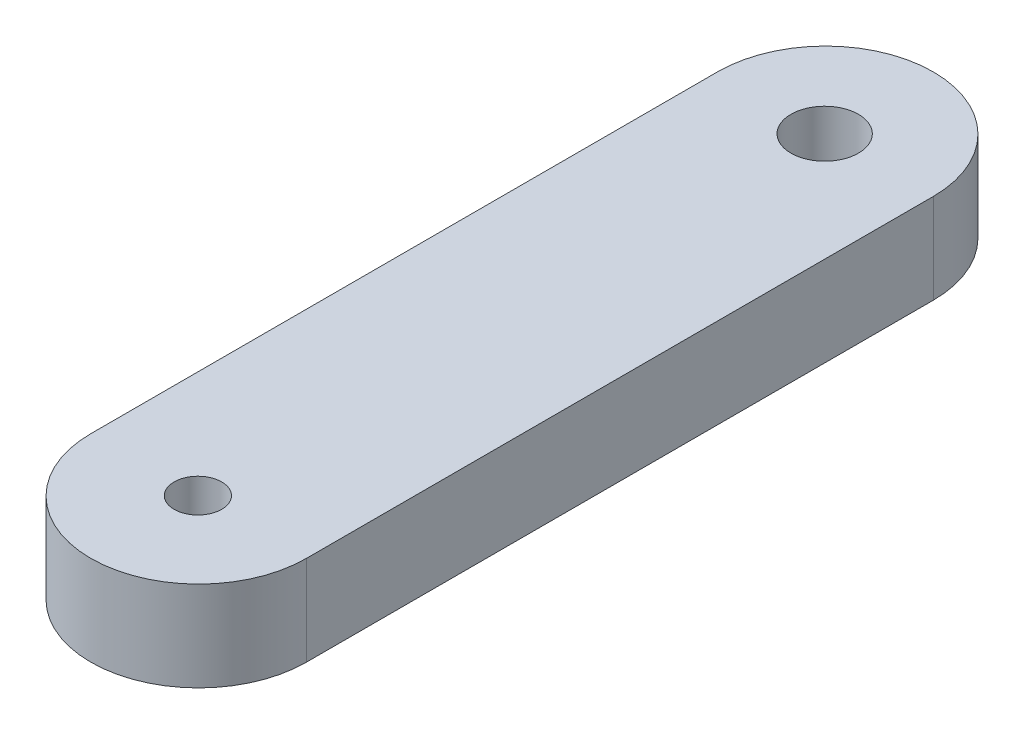
ISO-10303-21;
HEADER;
FILE_DESCRIPTION(('STEP AP214'),'2;1');
FILE_NAME('part.step','',(''),(''),'','','');
FILE_SCHEMA(('AUTOMOTIVE_DESIGN { 1 0 10303 214 1 1 1 1 }'));
ENDSEC;
DATA;
#1=APPLICATION_CONTEXT('core data for automotive mechanical design processes');
#2=APPLICATION_PROTOCOL_DEFINITION('international standard','automotive_design',2000,#1);
#3=PRODUCT_CONTEXT('',#1,'mechanical');
#4=PRODUCT('Part','Part','',(#3));
#5=PRODUCT_RELATED_PRODUCT_CATEGORY('part','',(#4));
#6=PRODUCT_DEFINITION_FORMATION('','',#4);
#7=PRODUCT_DEFINITION_CONTEXT('part definition',#1,'design');
#8=PRODUCT_DEFINITION('design','',#6,#7);
#9=PRODUCT_DEFINITION_SHAPE('','',#8);
#10=(LENGTH_UNIT() NAMED_UNIT(*) SI_UNIT(.MILLI.,.METRE.));
#11=(NAMED_UNIT(*) PLANE_ANGLE_UNIT() SI_UNIT($,.RADIAN.));
#12=(NAMED_UNIT(*) SI_UNIT($,.STERADIAN.) SOLID_ANGLE_UNIT());
#13=UNCERTAINTY_MEASURE_WITH_UNIT(LENGTH_MEASURE(1.E-05),#10,'distance_accuracy_value','');
#14=(GEOMETRIC_REPRESENTATION_CONTEXT(3) GLOBAL_UNCERTAINTY_ASSIGNED_CONTEXT((#13)) GLOBAL_UNIT_ASSIGNED_CONTEXT((#10,
#11,#12)) REPRESENTATION_CONTEXT('',''));
#15=CARTESIAN_POINT('',(0.,0.,0.));
#16=DIRECTION('',(0.,0.,1.));
#17=DIRECTION('',(1.,0.,0.));
#18=AXIS2_PLACEMENT_3D('',#15,#16,#17);
#19=CARTESIAN_POINT('',(0.0250618398966646,3.175,0.));
#20=DIRECTION('',(0.,-1.,0.));
#21=DIRECTION('',(0.,0.,-1.));
#22=AXIS2_PLACEMENT_3D('',#19,#20,#21);
#23=PLANE('',#22);
#24=CARTESIAN_POINT('',(0.0250618398966646,3.175,0.));
#25=DIRECTION('',(0.,1.,0.));
#26=DIRECTION('',(0.,0.,-1.));
#27=AXIS2_PLACEMENT_3D('',#24,#25,#26);
#28=CIRCLE('',#27,3.81);
#29=CARTESIAN_POINT('',(-3.78493816010333,3.175,0.));
#30=VERTEX_POINT('',#29);
#31=CARTESIAN_POINT('',(3.83506183989666,3.175,0.));
#32=VERTEX_POINT('',#31);
#33=EDGE_CURVE('E85',#30,#32,#28,.T.);
#34=ORIENTED_EDGE('',*,*,#33,.T.);
#35=DIRECTION('',(0.,0.,-1.));
#36=VECTOR('',#35,1.);
#37=CARTESIAN_POINT('',(3.83506183989666,3.175,-22.1335092));
#38=LINE('',#37,#36);
#39=CARTESIAN_POINT('',(3.83506183989666,3.175,-22.1335092));
#40=VERTEX_POINT('',#39);
#41=EDGE_CURVE('E80',#32,#40,#38,.T.);
#42=ORIENTED_EDGE('',*,*,#41,.T.);
#43=CARTESIAN_POINT('',(0.0250618398966646,3.175,-22.1335092));
#44=DIRECTION('',(0.,1.,0.));
#45=DIRECTION('',(0.,0.,-1.));
#46=AXIS2_PLACEMENT_3D('',#43,#44,#45);
#47=CIRCLE('',#46,3.81);
#48=CARTESIAN_POINT('',(-3.78493816010333,3.175,-22.1335092));
#49=VERTEX_POINT('',#48);
#50=EDGE_CURVE('E83',#40,#49,#47,.T.);
#51=ORIENTED_EDGE('',*,*,#50,.T.);
#52=DIRECTION('',(0.,0.,1.));
#53=VECTOR('',#52,1.);
#54=CARTESIAN_POINT('',(-3.78493816010333,3.175,0.));
#55=LINE('',#54,#53);
#56=EDGE_CURVE('E50',#49,#30,#55,.T.);
#57=ORIENTED_EDGE('',*,*,#56,.T.);
#58=EDGE_LOOP('',(#34,#42,#51,#57));
#59=FACE_BOUND('',#58,.T.);
#60=CARTESIAN_POINT('',(0.,3.175,-22.1335092));
#61=DIRECTION('',(0.,1.,0.));
#62=DIRECTION('',(0.,0.,1.));
#63=AXIS2_PLACEMENT_3D('',#60,#61,#62);
#64=CIRCLE('',#63,1.190625);
#65=CARTESIAN_POINT('',(0.,3.175,-20.9428842));
#66=VERTEX_POINT('',#65);
#67=EDGE_CURVE('E100',#66,#66,#64,.T.);
#68=ORIENTED_EDGE('',*,*,#67,.F.);
#69=EDGE_LOOP('',(#68));
#70=FACE_BOUND('',#69,.T.);
#71=CARTESIAN_POINT('',(0.,3.175,0.));
#72=DIRECTION('',(0.,1.,0.));
#73=DIRECTION('',(0.,0.,1.));
#74=AXIS2_PLACEMENT_3D('',#71,#72,#73);
#75=CIRCLE('',#74,0.840105);
#76=CARTESIAN_POINT('',(0.,3.175,0.840105));
#77=VERTEX_POINT('',#76);
#78=EDGE_CURVE('E115',#77,#77,#75,.T.);
#79=ORIENTED_EDGE('',*,*,#78,.F.);
#80=EDGE_LOOP('',(#79));
#81=FACE_BOUND('',#80,.T.);
#82=ADVANCED_FACE('F33',(#59,#70,#81),#23,.F.);
#83=CARTESIAN_POINT('',(0.0250618398966646,0.,0.));
#84=DIRECTION('',(0.,-1.,0.));
#85=DIRECTION('',(0.,0.,-1.));
#86=AXIS2_PLACEMENT_3D('',#83,#84,#85);
#87=PLANE('',#86);
#88=CARTESIAN_POINT('',(0.,0.,-22.1335092));
#89=DIRECTION('',(0.,1.,0.));
#90=DIRECTION('',(0.,0.,1.));
#91=AXIS2_PLACEMENT_3D('',#88,#89,#90);
#92=CIRCLE('',#91,1.190625);
#93=CARTESIAN_POINT('',(0.,0.,-20.9428842));
#94=VERTEX_POINT('',#93);
#95=EDGE_CURVE('E112',#94,#94,#92,.T.);
#96=ORIENTED_EDGE('',*,*,#95,.T.);
#97=EDGE_LOOP('',(#96));
#98=FACE_BOUND('',#97,.T.);
#99=CARTESIAN_POINT('',(0.0250618398966646,0.,0.));
#100=DIRECTION('',(0.,1.,0.));
#101=DIRECTION('',(0.,0.,-1.));
#102=AXIS2_PLACEMENT_3D('',#99,#100,#101);
#103=CIRCLE('',#102,3.81);
#104=CARTESIAN_POINT('',(-3.78493816010333,0.,0.));
#105=VERTEX_POINT('',#104);
#106=CARTESIAN_POINT('',(3.83506183989666,0.,0.));
#107=VERTEX_POINT('',#106);
#108=EDGE_CURVE('E97',#105,#107,#103,.T.);
#109=ORIENTED_EDGE('',*,*,#108,.F.);
#110=DIRECTION('',(0.,0.,1.));
#111=VECTOR('',#110,1.);
#112=CARTESIAN_POINT('',(-3.78493816010333,0.,0.));
#113=LINE('',#112,#111);
#114=CARTESIAN_POINT('',(-3.78493816010333,0.,-22.1335092));
#115=VERTEX_POINT('',#114);
#116=EDGE_CURVE('E73',#115,#105,#113,.T.);
#117=ORIENTED_EDGE('',*,*,#116,.F.);
#118=CARTESIAN_POINT('',(0.0250618398966646,0.,-22.1335092));
#119=DIRECTION('',(0.,1.,0.));
#120=DIRECTION('',(0.,0.,-1.));
#121=AXIS2_PLACEMENT_3D('',#118,#119,#120);
#122=CIRCLE('',#121,3.81);
#123=CARTESIAN_POINT('',(3.83506183989666,0.,-22.1335092));
#124=VERTEX_POINT('',#123);
#125=EDGE_CURVE('E67',#124,#115,#122,.T.);
#126=ORIENTED_EDGE('',*,*,#125,.F.);
#127=DIRECTION('',(0.,0.,-1.));
#128=VECTOR('',#127,1.);
#129=CARTESIAN_POINT('',(3.83506183989666,0.,-22.1335092));
#130=LINE('',#129,#128);
#131=EDGE_CURVE('E89',#107,#124,#130,.T.);
#132=ORIENTED_EDGE('',*,*,#131,.F.);
#133=EDGE_LOOP('',(#109,#117,#126,#132));
#134=FACE_BOUND('',#133,.T.);
#135=CARTESIAN_POINT('',(0.,0.,0.));
#136=DIRECTION('',(0.,1.,0.));
#137=DIRECTION('',(0.,0.,1.));
#138=AXIS2_PLACEMENT_3D('',#135,#136,#137);
#139=CIRCLE('',#138,0.840105);
#140=CARTESIAN_POINT('',(0.,0.,0.840105));
#141=VERTEX_POINT('',#140);
#142=EDGE_CURVE('E118',#141,#141,#139,.T.);
#143=ORIENTED_EDGE('',*,*,#142,.T.);
#144=EDGE_LOOP('',(#143));
#145=FACE_BOUND('',#144,.T.);
#146=ADVANCED_FACE('F108',(#98,#134,#145),#87,.T.);
#147=CARTESIAN_POINT('',(0.0250618398966646,3.175,0.));
#148=DIRECTION('',(0.,-1.,0.));
#149=DIRECTION('',(0.,0.,-1.));
#150=AXIS2_PLACEMENT_3D('',#147,#148,#149);
#151=CYLINDRICAL_SURFACE('',#150,3.81);
#152=ORIENTED_EDGE('',*,*,#108,.T.);
#153=DIRECTION('',(0.,-1.,0.));
#154=VECTOR('',#153,1.);
#155=CARTESIAN_POINT('',(3.83506183989666,3.175,0.));
#156=LINE('',#155,#154);
#157=EDGE_CURVE('E11',#32,#107,#156,.T.);
#158=ORIENTED_EDGE('',*,*,#157,.F.);
#159=ORIENTED_EDGE('',*,*,#33,.F.);
#160=DIRECTION('',(0.,-1.,0.));
#161=VECTOR('',#160,1.);
#162=CARTESIAN_POINT('',(-3.78493816010333,3.175,0.));
#163=LINE('',#162,#161);
#164=EDGE_CURVE('E93',#30,#105,#163,.T.);
#165=ORIENTED_EDGE('',*,*,#164,.T.);
#166=EDGE_LOOP('',(#152,#158,#159,#165));
#167=FACE_BOUND('',#166,.T.);
#168=ADVANCED_FACE('F35',(#167),#151,.T.);
#169=CARTESIAN_POINT('',(3.83506183989666,3.175,-22.1335092));
#170=DIRECTION('',(-1.,0.,0.));
#171=DIRECTION('',(0.,0.,1.));
#172=AXIS2_PLACEMENT_3D('',#169,#170,#171);
#173=PLANE('',#172);
#174=ORIENTED_EDGE('',*,*,#131,.T.);
#175=DIRECTION('',(0.,-1.,0.));
#176=VECTOR('',#175,1.);
#177=CARTESIAN_POINT('',(3.83506183989666,3.175,-22.1335092));
#178=LINE('',#177,#176);
#179=EDGE_CURVE('E42',#40,#124,#178,.T.);
#180=ORIENTED_EDGE('',*,*,#179,.F.);
#181=ORIENTED_EDGE('',*,*,#41,.F.);
#182=ORIENTED_EDGE('',*,*,#157,.T.);
#183=EDGE_LOOP('',(#174,#180,#181,#182));
#184=FACE_BOUND('',#183,.T.);
#185=ADVANCED_FACE('F88',(#184),#173,.F.);
#186=CARTESIAN_POINT('',(0.0250618398966646,3.175,-22.1335092));
#187=DIRECTION('',(0.,-1.,0.));
#188=DIRECTION('',(0.,0.,-1.));
#189=AXIS2_PLACEMENT_3D('',#186,#187,#188);
#190=CYLINDRICAL_SURFACE('',#189,3.81);
#191=ORIENTED_EDGE('',*,*,#125,.T.);
#192=DIRECTION('',(0.,-1.,0.));
#193=VECTOR('',#192,1.);
#194=CARTESIAN_POINT('',(-3.78493816010333,3.175,-22.1335092));
#195=LINE('',#194,#193);
#196=EDGE_CURVE('E90',#49,#115,#195,.T.);
#197=ORIENTED_EDGE('',*,*,#196,.F.);
#198=ORIENTED_EDGE('',*,*,#50,.F.);
#199=ORIENTED_EDGE('',*,*,#179,.T.);
#200=EDGE_LOOP('',(#191,#197,#198,#199));
#201=FACE_BOUND('',#200,.T.);
#202=ADVANCED_FACE('F91',(#201),#190,.T.);
#203=CARTESIAN_POINT('',(-3.78493816010333,3.175,0.));
#204=DIRECTION('',(1.,0.,0.));
#205=DIRECTION('',(0.,0.,-1.));
#206=AXIS2_PLACEMENT_3D('',#203,#204,#205);
#207=PLANE('',#206);
#208=ORIENTED_EDGE('',*,*,#116,.T.);
#209=ORIENTED_EDGE('',*,*,#164,.F.);
#210=ORIENTED_EDGE('',*,*,#56,.F.);
#211=ORIENTED_EDGE('',*,*,#196,.T.);
#212=EDGE_LOOP('',(#208,#209,#210,#211));
#213=FACE_BOUND('',#212,.T.);
#214=ADVANCED_FACE('F105',(#213),#207,.F.);
#215=CARTESIAN_POINT('',(0.,3.175,-22.1335092));
#216=DIRECTION('',(0.,-1.,0.));
#217=DIRECTION('',(0.,0.,-1.));
#218=AXIS2_PLACEMENT_3D('',#215,#216,#217);
#219=CYLINDRICAL_SURFACE('',#218,1.190625);
#220=ORIENTED_EDGE('',*,*,#67,.T.);
#221=EDGE_LOOP('',(#220));
#222=FACE_BOUND('',#221,.T.);
#223=ORIENTED_EDGE('',*,*,#95,.F.);
#224=EDGE_LOOP('',(#223));
#225=FACE_BOUND('',#224,.T.);
#226=ADVANCED_FACE('F135',(#222,#225),#219,.F.);
#227=CARTESIAN_POINT('',(0.,3.175,0.));
#228=DIRECTION('',(0.,-1.,0.));
#229=DIRECTION('',(0.,0.,-1.));
#230=AXIS2_PLACEMENT_3D('',#227,#228,#229);
#231=CYLINDRICAL_SURFACE('',#230,0.840105);
#232=ORIENTED_EDGE('',*,*,#78,.T.);
#233=EDGE_LOOP('',(#232));
#234=FACE_BOUND('',#233,.T.);
#235=ORIENTED_EDGE('',*,*,#142,.F.);
#236=EDGE_LOOP('',(#235));
#237=FACE_BOUND('',#236,.T.);
#238=ADVANCED_FACE('F124',(#234,#237),#231,.F.);
#239=CLOSED_SHELL('',(#82,#146,#168,#185,#202,#214,#226,#238));
#240=MANIFOLD_SOLID_BREP('B2',#239);
#241=ADVANCED_BREP_SHAPE_REPRESENTATION('',(#18,#240),#14);
#242=SHAPE_DEFINITION_REPRESENTATION(#9,#241);
ENDSEC;
END-ISO-10303-21;
